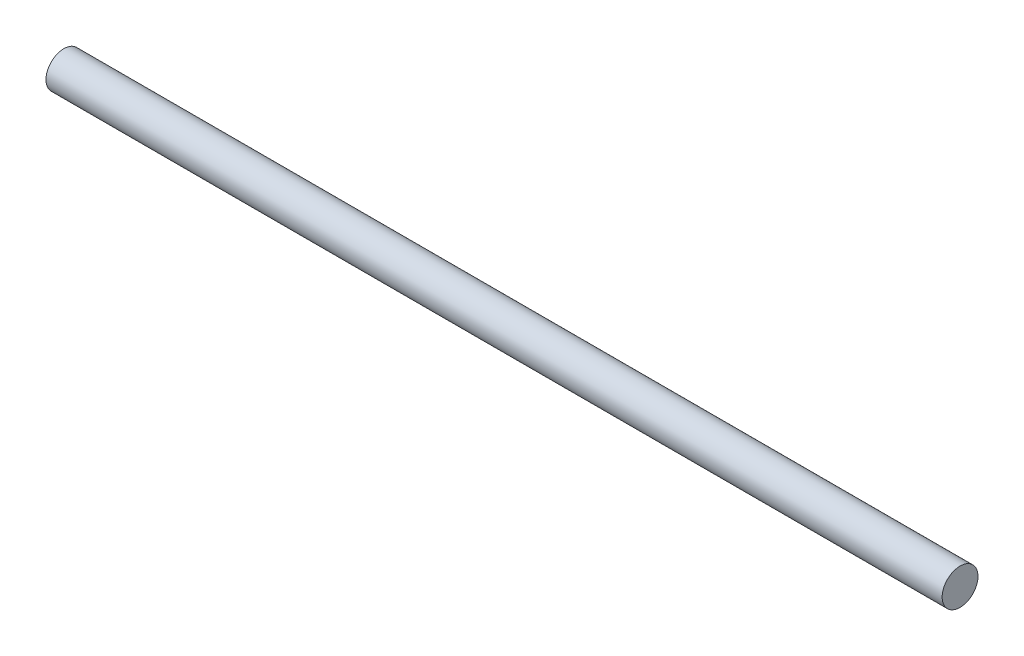
ISO-10303-21;
HEADER;
FILE_DESCRIPTION(('STEP AP214'),'2;1');
FILE_NAME('part.step','',(''),(''),'','','');
FILE_SCHEMA(('AUTOMOTIVE_DESIGN { 1 0 10303 214 1 1 1 1 }'));
ENDSEC;
DATA;
#1=APPLICATION_CONTEXT('core data for automotive mechanical design processes');
#2=APPLICATION_PROTOCOL_DEFINITION('international standard','automotive_design',2000,#1);
#3=PRODUCT_CONTEXT('',#1,'mechanical');
#4=PRODUCT('Part','Part','',(#3));
#5=PRODUCT_RELATED_PRODUCT_CATEGORY('part','',(#4));
#6=PRODUCT_DEFINITION_FORMATION('','',#4);
#7=PRODUCT_DEFINITION_CONTEXT('part definition',#1,'design');
#8=PRODUCT_DEFINITION('design','',#6,#7);
#9=PRODUCT_DEFINITION_SHAPE('','',#8);
#10=(LENGTH_UNIT() NAMED_UNIT(*) SI_UNIT(.MILLI.,.METRE.));
#11=(NAMED_UNIT(*) PLANE_ANGLE_UNIT() SI_UNIT($,.RADIAN.));
#12=(NAMED_UNIT(*) SI_UNIT($,.STERADIAN.) SOLID_ANGLE_UNIT());
#13=UNCERTAINTY_MEASURE_WITH_UNIT(LENGTH_MEASURE(1.E-05),#10,'distance_accuracy_value','');
#14=(GEOMETRIC_REPRESENTATION_CONTEXT(3) GLOBAL_UNCERTAINTY_ASSIGNED_CONTEXT((#13)) GLOBAL_UNIT_ASSIGNED_CONTEXT((#10,
#11,#12)) REPRESENTATION_CONTEXT('',''));
#15=CARTESIAN_POINT('',(0.,0.,0.));
#16=DIRECTION('',(0.,0.,1.));
#17=DIRECTION('',(1.,0.,0.));
#18=AXIS2_PLACEMENT_3D('',#15,#16,#17);
#19=CARTESIAN_POINT('',(500.,0.,0.));
#20=DIRECTION('',(-1.,0.,0.));
#21=DIRECTION('',(0.,0.,1.));
#22=AXIS2_PLACEMENT_3D('',#19,#20,#21);
#23=CYLINDRICAL_SURFACE('',#22,10.);
#24=CARTESIAN_POINT('',(500.,0.,0.));
#25=DIRECTION('',(1.,0.,0.));
#26=DIRECTION('',(0.,0.,-1.));
#27=AXIS2_PLACEMENT_3D('',#24,#25,#26);
#28=CIRCLE('',#27,10.);
#29=CARTESIAN_POINT('',(500.,0.,-10.));
#30=VERTEX_POINT('',#29);
#31=EDGE_CURVE('E10',#30,#30,#28,.T.);
#32=ORIENTED_EDGE('',*,*,#31,.F.);
#33=EDGE_LOOP('',(#32));
#34=FACE_BOUND('',#33,.T.);
#35=CARTESIAN_POINT('',(0.,0.,0.));
#36=DIRECTION('',(1.,0.,0.));
#37=DIRECTION('',(0.,0.,-1.));
#38=AXIS2_PLACEMENT_3D('',#35,#36,#37);
#39=CIRCLE('',#38,10.);
#40=CARTESIAN_POINT('',(0.,0.,-10.));
#41=VERTEX_POINT('',#40);
#42=EDGE_CURVE('E38',#41,#41,#39,.T.);
#43=ORIENTED_EDGE('',*,*,#42,.T.);
#44=EDGE_LOOP('',(#43));
#45=FACE_BOUND('',#44,.T.);
#46=ADVANCED_FACE('F35',(#34,#45),#23,.T.);
#47=CARTESIAN_POINT('',(500.,0.,0.));
#48=DIRECTION('',(1.,0.,0.));
#49=DIRECTION('',(0.,0.,-1.));
#50=AXIS2_PLACEMENT_3D('',#47,#48,#49);
#51=PLANE('',#50);
#52=ORIENTED_EDGE('',*,*,#31,.T.);
#53=EDGE_LOOP('',(#52));
#54=FACE_BOUND('',#53,.T.);
#55=ADVANCED_FACE('F50',(#54),#51,.T.);
#56=CARTESIAN_POINT('',(0.,0.,0.));
#57=DIRECTION('',(1.,0.,0.));
#58=DIRECTION('',(0.,0.,-1.));
#59=AXIS2_PLACEMENT_3D('',#56,#57,#58);
#60=PLANE('',#59);
#61=ORIENTED_EDGE('',*,*,#42,.F.);
#62=EDGE_LOOP('',(#61));
#63=FACE_BOUND('',#62,.T.);
#64=ADVANCED_FACE('F48',(#63),#60,.F.);
#65=CLOSED_SHELL('',(#46,#55,#64));
#66=MANIFOLD_SOLID_BREP('B2',#65);
#67=ADVANCED_BREP_SHAPE_REPRESENTATION('',(#18,#66),#14);
#68=SHAPE_DEFINITION_REPRESENTATION(#9,#67);
ENDSEC;
END-ISO-10303-21;
